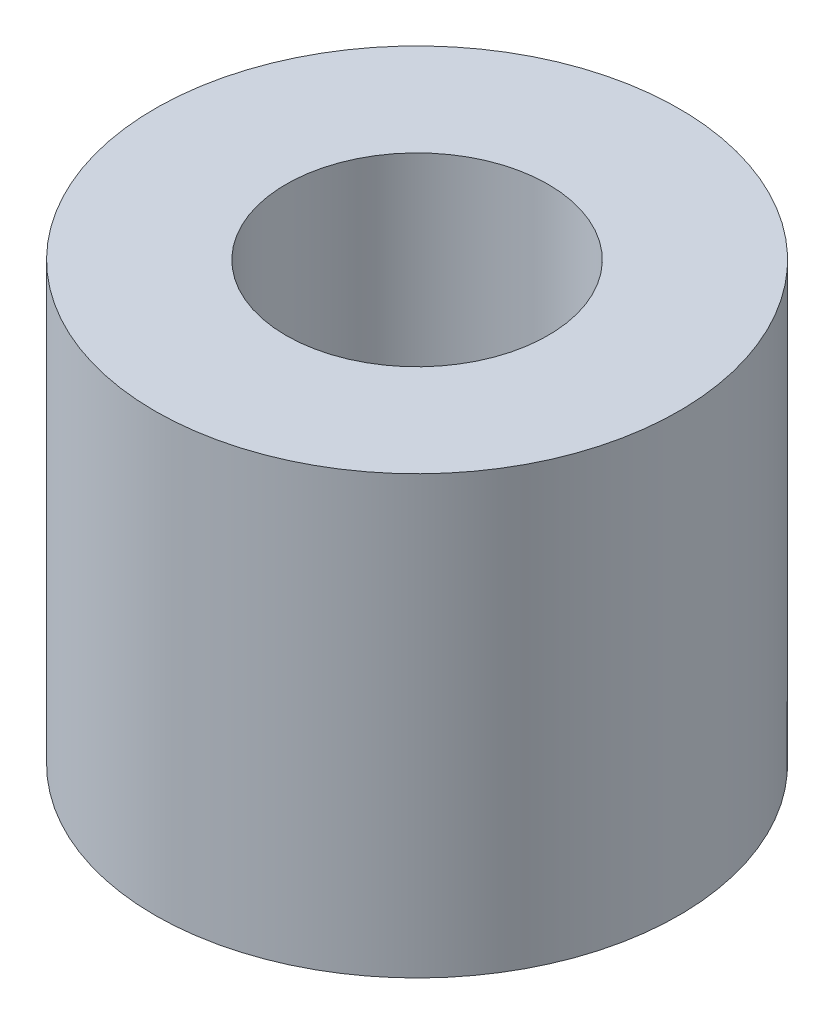
ISO-10303-21;
HEADER;
FILE_DESCRIPTION(('STEP AP214'),'2;1');
FILE_NAME('part.step','',(''),(''),'','','');
FILE_SCHEMA(('AUTOMOTIVE_DESIGN { 1 0 10303 214 1 1 1 1 }'));
ENDSEC;
DATA;
#1=APPLICATION_CONTEXT('core data for automotive mechanical design processes');
#2=APPLICATION_PROTOCOL_DEFINITION('international standard','automotive_design',2000,#1);
#3=PRODUCT_CONTEXT('',#1,'mechanical');
#4=PRODUCT('Part','Part','',(#3));
#5=PRODUCT_RELATED_PRODUCT_CATEGORY('part','',(#4));
#6=PRODUCT_DEFINITION_FORMATION('','',#4);
#7=PRODUCT_DEFINITION_CONTEXT('part definition',#1,'design');
#8=PRODUCT_DEFINITION('design','',#6,#7);
#9=PRODUCT_DEFINITION_SHAPE('','',#8);
#10=(LENGTH_UNIT() NAMED_UNIT(*) SI_UNIT(.MILLI.,.METRE.));
#11=(NAMED_UNIT(*) PLANE_ANGLE_UNIT() SI_UNIT($,.RADIAN.));
#12=(NAMED_UNIT(*) SI_UNIT($,.STERADIAN.) SOLID_ANGLE_UNIT());
#13=UNCERTAINTY_MEASURE_WITH_UNIT(LENGTH_MEASURE(1.E-05),#10,'distance_accuracy_value','');
#14=(GEOMETRIC_REPRESENTATION_CONTEXT(3) GLOBAL_UNCERTAINTY_ASSIGNED_CONTEXT((#13)) GLOBAL_UNIT_ASSIGNED_CONTEXT((#10,
#11,#12)) REPRESENTATION_CONTEXT('',''));
#15=CARTESIAN_POINT('',(0.,0.,0.));
#16=DIRECTION('',(0.,0.,1.));
#17=DIRECTION('',(1.,0.,0.));
#18=AXIS2_PLACEMENT_3D('',#15,#16,#17);
#19=CARTESIAN_POINT('',(0.,5.,0.));
#20=DIRECTION('',(0.,-1.,0.));
#21=DIRECTION('',(0.,0.,-1.));
#22=AXIS2_PLACEMENT_3D('',#19,#20,#21);
#23=CYLINDRICAL_SURFACE('',#22,3.);
#24=CARTESIAN_POINT('',(0.,5.,0.));
#25=DIRECTION('',(0.,1.,0.));
#26=DIRECTION('',(0.,0.,1.));
#27=AXIS2_PLACEMENT_3D('',#24,#25,#26);
#28=CIRCLE('',#27,3.);
#29=CARTESIAN_POINT('',(0.,5.,3.));
#30=VERTEX_POINT('',#29);
#31=EDGE_CURVE('E10',#30,#30,#28,.T.);
#32=ORIENTED_EDGE('',*,*,#31,.F.);
#33=EDGE_LOOP('',(#32));
#34=FACE_BOUND('',#33,.T.);
#35=CARTESIAN_POINT('',(0.,0.,0.));
#36=DIRECTION('',(0.,1.,0.));
#37=DIRECTION('',(0.,0.,1.));
#38=AXIS2_PLACEMENT_3D('',#35,#36,#37);
#39=CIRCLE('',#38,3.);
#40=CARTESIAN_POINT('',(0.,0.,3.));
#41=VERTEX_POINT('',#40);
#42=EDGE_CURVE('E34',#41,#41,#39,.T.);
#43=ORIENTED_EDGE('',*,*,#42,.T.);
#44=EDGE_LOOP('',(#43));
#45=FACE_BOUND('',#44,.T.);
#46=ADVANCED_FACE('F31',(#34,#45),#23,.T.);
#47=CARTESIAN_POINT('',(0.,5.,0.));
#48=DIRECTION('',(0.,1.,0.));
#49=DIRECTION('',(0.,0.,1.));
#50=AXIS2_PLACEMENT_3D('',#47,#48,#49);
#51=PLANE('',#50);
#52=CARTESIAN_POINT('',(0.,5.,0.));
#53=DIRECTION('',(0.,1.,0.));
#54=DIRECTION('',(0.,0.,1.));
#55=AXIS2_PLACEMENT_3D('',#52,#53,#54);
#56=CIRCLE('',#55,1.5);
#57=CARTESIAN_POINT('',(0.,5.,1.5));
#58=VERTEX_POINT('',#57);
#59=EDGE_CURVE('E43',#58,#58,#56,.T.);
#60=ORIENTED_EDGE('',*,*,#59,.F.);
#61=EDGE_LOOP('',(#60));
#62=FACE_BOUND('',#61,.T.);
#63=ORIENTED_EDGE('',*,*,#31,.T.);
#64=EDGE_LOOP('',(#63));
#65=FACE_BOUND('',#64,.T.);
#66=ADVANCED_FACE('F58',(#62,#65),#51,.T.);
#67=CARTESIAN_POINT('',(0.,0.,0.));
#68=DIRECTION('',(0.,1.,0.));
#69=DIRECTION('',(0.,0.,1.));
#70=AXIS2_PLACEMENT_3D('',#67,#68,#69);
#71=PLANE('',#70);
#72=ORIENTED_EDGE('',*,*,#42,.F.);
#73=EDGE_LOOP('',(#72));
#74=FACE_BOUND('',#73,.T.);
#75=ADVANCED_FACE('F54',(#74),#71,.F.);
#76=CARTESIAN_POINT('',(0.,1.,0.));
#77=DIRECTION('',(0.,1.,0.));
#78=DIRECTION('',(0.,0.,1.));
#79=AXIS2_PLACEMENT_3D('',#76,#77,#78);
#80=CYLINDRICAL_SURFACE('',#79,1.5);
#81=CARTESIAN_POINT('',(0.,1.,0.));
#82=DIRECTION('',(0.,1.,0.));
#83=DIRECTION('',(0.,0.,1.));
#84=AXIS2_PLACEMENT_3D('',#81,#82,#83);
#85=CIRCLE('',#84,1.5);
#86=CARTESIAN_POINT('',(0.,1.,1.5));
#87=VERTEX_POINT('',#86);
#88=EDGE_CURVE('E41',#87,#87,#85,.T.);
#89=ORIENTED_EDGE('',*,*,#88,.F.);
#90=EDGE_LOOP('',(#89));
#91=FACE_BOUND('',#90,.T.);
#92=ORIENTED_EDGE('',*,*,#59,.T.);
#93=EDGE_LOOP('',(#92));
#94=FACE_BOUND('',#93,.T.);
#95=ADVANCED_FACE('F51',(#91,#94),#80,.F.);
#96=CARTESIAN_POINT('',(0.,1.,0.));
#97=DIRECTION('',(0.,1.,0.));
#98=DIRECTION('',(0.,0.,1.));
#99=AXIS2_PLACEMENT_3D('',#96,#97,#98);
#100=PLANE('',#99);
#101=ORIENTED_EDGE('',*,*,#88,.T.);
#102=EDGE_LOOP('',(#101));
#103=FACE_BOUND('',#102,.T.);
#104=ADVANCED_FACE('F49',(#103),#100,.T.);
#105=CLOSED_SHELL('',(#46,#66,#75,#95,#104));
#106=MANIFOLD_SOLID_BREP('B2',#105);
#107=ADVANCED_BREP_SHAPE_REPRESENTATION('',(#18,#106),#14);
#108=SHAPE_DEFINITION_REPRESENTATION(#9,#107);
ENDSEC;
END-ISO-10303-21;
